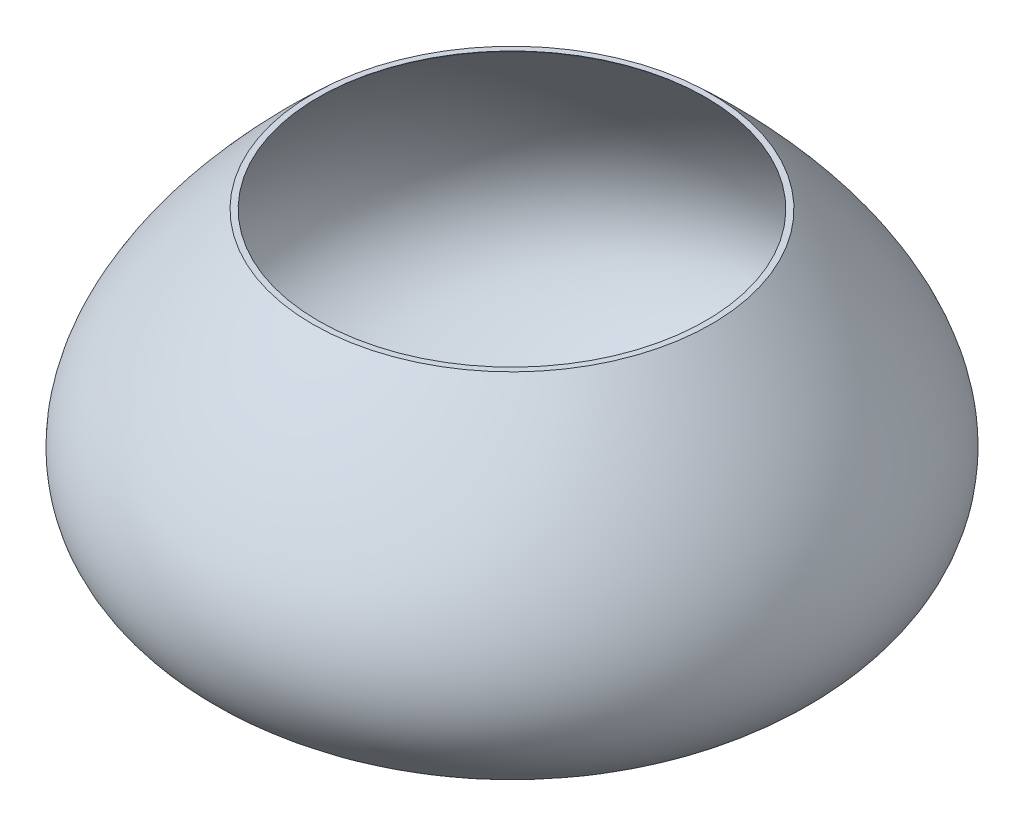
ISO-10303-21;
HEADER;
FILE_DESCRIPTION(('STEP AP214'),'2;1');
FILE_NAME('part.step','',(''),(''),'','','');
FILE_SCHEMA(('AUTOMOTIVE_DESIGN { 1 0 10303 214 1 1 1 1 }'));
ENDSEC;
DATA;
#1=APPLICATION_CONTEXT('core data for automotive mechanical design processes');
#2=APPLICATION_PROTOCOL_DEFINITION('international standard','automotive_design',2000,#1);
#3=PRODUCT_CONTEXT('',#1,'mechanical');
#4=PRODUCT('Part','Part','',(#3));
#5=PRODUCT_RELATED_PRODUCT_CATEGORY('part','',(#4));
#6=PRODUCT_DEFINITION_FORMATION('','',#4);
#7=PRODUCT_DEFINITION_CONTEXT('part definition',#1,'design');
#8=PRODUCT_DEFINITION('design','',#6,#7);
#9=PRODUCT_DEFINITION_SHAPE('','',#8);
#10=(LENGTH_UNIT() NAMED_UNIT(*) SI_UNIT(.MILLI.,.METRE.));
#11=(NAMED_UNIT(*) PLANE_ANGLE_UNIT() SI_UNIT($,.RADIAN.));
#12=(NAMED_UNIT(*) SI_UNIT($,.STERADIAN.) SOLID_ANGLE_UNIT());
#13=UNCERTAINTY_MEASURE_WITH_UNIT(LENGTH_MEASURE(1.E-05),#10,'distance_accuracy_value','');
#14=(GEOMETRIC_REPRESENTATION_CONTEXT(3) GLOBAL_UNCERTAINTY_ASSIGNED_CONTEXT((#13)) GLOBAL_UNIT_ASSIGNED_CONTEXT((#10,
#11,#12)) REPRESENTATION_CONTEXT('',''));
#15=CARTESIAN_POINT('',(0.,0.,0.));
#16=DIRECTION('',(0.,0.,1.));
#17=DIRECTION('',(1.,0.,0.));
#18=AXIS2_PLACEMENT_3D('',#15,#16,#17);
#19=CARTESIAN_POINT('',(-50.7284958703985,42.6156665675958,0.));
#20=CARTESIAN_POINT('',(-130.028085948942,-31.1828525754335,0.));
#21=CARTESIAN_POINT('',(-19.3961895975053,-51.5677540741368,0.));
#22=B_SPLINE_CURVE_WITH_KNOTS('',2,(#19,#20,#21),.UNSPECIFIED.,.F.,.F.,(3,3),(0.,1.),.UNSPECIFIED.);
#23=CARTESIAN_POINT('',(0.,42.6156665675958,0.));
#24=DIRECTION('',(0.,1.,0.));
#25=AXIS1_PLACEMENT('',#23,#24);
#26=SURFACE_OF_REVOLUTION('',#22,#25);
#27=CARTESIAN_POINT('',(0.,-51.5677540741368,0.));
#28=DIRECTION('',(0.,1.,0.));
#29=DIRECTION('',(0.,0.,1.));
#30=AXIS2_PLACEMENT_3D('',#27,#28,#29);
#31=CIRCLE('',#30,19.3961895975053);
#32=CARTESIAN_POINT('',(0.,-51.5677540741368,19.3961895975053));
#33=VERTEX_POINT('',#32);
#34=EDGE_CURVE('E41',#33,#33,#31,.T.);
#35=ORIENTED_EDGE('',*,*,#34,.T.);
#36=EDGE_LOOP('',(#35));
#37=FACE_BOUND('',#36,.T.);
#38=CARTESIAN_POINT('',(0.,42.6156665675958,0.));
#39=DIRECTION('',(0.,1.,0.));
#40=DIRECTION('',(0.,0.,1.));
#41=AXIS2_PLACEMENT_3D('',#38,#39,#40);
#42=CIRCLE('',#41,50.7284958703985);
#43=CARTESIAN_POINT('',(0.,42.6156665675958,50.7284958703985));
#44=VERTEX_POINT('',#43);
#45=EDGE_CURVE('E10',#44,#44,#42,.T.);
#46=ORIENTED_EDGE('',*,*,#45,.F.);
#47=EDGE_LOOP('',(#46));
#48=FACE_BOUND('',#47,.T.);
#49=ADVANCED_FACE('F33',(#37,#48),#26,.F.);
#50=CARTESIAN_POINT('',(-50.7284958703985,42.6156665675958,0.));
#51=DIRECTION('',(0.,1.,0.));
#52=DIRECTION('',(0.,0.,1.));
#53=AXIS2_PLACEMENT_3D('',#50,#51,#52);
#54=PLANE('',#53);
#55=CARTESIAN_POINT('',(0.,42.6156665675958,0.));
#56=DIRECTION('',(0.,1.,0.));
#57=DIRECTION('',(0.,0.,1.));
#58=AXIS2_PLACEMENT_3D('',#55,#56,#57);
#59=CIRCLE('',#58,49.2611135505124);
#60=CARTESIAN_POINT('',(0.,42.6156665675958,49.2611135505124));
#61=VERTEX_POINT('',#60);
#62=EDGE_CURVE('E37',#61,#61,#59,.T.);
#63=ORIENTED_EDGE('',*,*,#62,.F.);
#64=EDGE_LOOP('',(#63));
#65=FACE_BOUND('',#64,.T.);
#66=ORIENTED_EDGE('',*,*,#45,.T.);
#67=EDGE_LOOP('',(#66));
#68=FACE_BOUND('',#67,.T.);
#69=ADVANCED_FACE('F78',(#65,#68),#54,.T.);
#70=CARTESIAN_POINT('',(0.,-51.5677540741368,0.));
#71=DIRECTION('',(0.,-1.,0.));
#72=DIRECTION('',(0.,0.,-1.));
#73=AXIS2_PLACEMENT_3D('',#70,#71,#72);
#74=PLANE('',#73);
#75=ORIENTED_EDGE('',*,*,#34,.F.);
#76=EDGE_LOOP('',(#75));
#77=FACE_BOUND('',#76,.T.);
#78=ADVANCED_FACE('F75',(#77),#74,.T.);
#79=CARTESIAN_POINT('',(0.,-50.5843634446969,0.));
#80=DIRECTION('',(0.,-1.,0.));
#81=DIRECTION('',(0.,0.,-1.));
#82=AXIS2_PLACEMENT_3D('',#79,#80,#81);
#83=PLANE('',#82);
#84=CARTESIAN_POINT('',(0.,-50.5843634446969,0.));
#85=DIRECTION('',(0.,1.,0.));
#86=DIRECTION('',(0.,0.,1.));
#87=AXIS2_PLACEMENT_3D('',#84,#85,#86);
#88=CIRCLE('',#87,19.2146878897174);
#89=CARTESIAN_POINT('',(0.,-50.5843634446969,19.2146878897174));
#90=VERTEX_POINT('',#89);
#91=EDGE_CURVE('E50',#90,#90,#88,.T.);
#92=ORIENTED_EDGE('',*,*,#91,.T.);
#93=EDGE_LOOP('',(#92));
#94=FACE_BOUND('',#93,.T.);
#95=ADVANCED_FACE('F71',(#94),#83,.F.);
#96=CARTESIAN_POINT('',(-50.0470102163547,41.8838350956486,0.));
#97=CARTESIAN_POINT('',(-50.3258437096037,41.6241837513158,0.));
#98=CARTESIAN_POINT('',(-50.6023301269103,41.3658986733701,0.));
#99=CARTESIAN_POINT('',(-51.1556551569572,40.8463384670707,0.));
#100=CARTESIAN_POINT('',(-51.4317092392776,40.5859562664432,0.));
#101=CARTESIAN_POINT('',(-52.2580248060261,39.8029258201448,0.));
#102=CARTESIAN_POINT('',(-52.8064256894913,39.2784103825978,0.));
#103=CARTESIAN_POINT('',(-54.4437116957967,37.6970483158113,0.));
#104=CARTESIAN_POINT('',(-55.5246991014262,36.6323937921897,0.));
#105=CARTESIAN_POINT('',(-58.7315315788964,33.4042840263082,0.));
#106=CARTESIAN_POINT('',(-60.821705640731,31.2068347837701,0.));
#107=CARTESIAN_POINT('',(-64.8736389747032,26.7023904697895,0.));
#108=CARTESIAN_POINT('',(-66.8357625528101,24.3954108355314,0.));
#109=CARTESIAN_POINT('',(-70.5801975268923,19.6480617657973,0.));
#110=CARTESIAN_POINT('',(-72.363218661924,17.2075759004857,0.));
#111=CARTESIAN_POINT('',(-75.6639317446825,12.1651442504666,0.));
#112=CARTESIAN_POINT('',(-77.1828949415244,9.56250656816085,0.));
#113=CARTESIAN_POINT('',(-79.1508496521266,5.52053947860333,0.));
#114=CARTESIAN_POINT('',(-79.7544533177836,4.15029922236088,0.));
#115=CARTESIAN_POINT('',(-80.8286403154789,1.36501877511502,0.));
#116=CARTESIAN_POINT('',(-81.299207918134,-0.0501519877099527,0.));
#117=CARTESIAN_POINT('',(-82.0718969999994,-2.91838189055625,0.));
#118=CARTESIAN_POINT('',(-82.3738479452341,-4.37159693233014,0.));
#119=CARTESIAN_POINT('',(-82.7689979817292,-7.29852293386176,0.));
#120=CARTESIAN_POINT('',(-82.8617748389176,-8.7722786900836,0.));
#121=CARTESIAN_POINT('',(-82.8020258639494,-11.7087712294951,0.));
#122=CARTESIAN_POINT('',(-82.6489714106115,-13.1712340771969,0.));
#123=CARTESIAN_POINT('',(-82.0800136139683,-16.0422431243442,0.));
#124=CARTESIAN_POINT('',(-81.6639729912247,-17.4502619461596,0.));
#125=CARTESIAN_POINT('',(-80.5825122919221,-20.1708947390536,0.));
#126=CARTESIAN_POINT('',(-79.9175506740652,-21.4831844228895,0.));
#127=CARTESIAN_POINT('',(-78.3779381697122,-23.9868773203778,0.));
#128=CARTESIAN_POINT('',(-77.503863940475,-25.1783700414302,0.));
#129=CARTESIAN_POINT('',(-75.5942985663853,-27.4347408930068,0.));
#130=CARTESIAN_POINT('',(-74.5590996945951,-28.4998819692524,0.));
#131=CARTESIAN_POINT('',(-72.3700351134111,-30.5111595679,0.));
#132=CARTESIAN_POINT('',(-71.2162084181214,-31.4575031695101,0.));
#133=CARTESIAN_POINT('',(-67.6256569751839,-34.1378210281417,0.));
#134=CARTESIAN_POINT('',(-65.063151448962,-35.7140101622726,0.));
#135=CARTESIAN_POINT('',(-59.7598847419551,-38.5516794629408,0.));
#136=CARTESIAN_POINT('',(-57.0172219768374,-39.8135006537529,0.));
#137=CARTESIAN_POINT('',(-51.4293254057354,-42.1037959098136,0.));
#138=CARTESIAN_POINT('',(-48.5831541282288,-43.1320155532147,0.));
#139=CARTESIAN_POINT('',(-42.8278684468857,-45.0103865965986,0.));
#140=CARTESIAN_POINT('',(-39.9183310594402,-45.8602997929853,0.));
#141=CARTESIAN_POINT('',(-34.0586032158574,-47.4202161385998,0.));
#142=CARTESIAN_POINT('',(-31.1082152879589,-48.1300608476452,0.));
#143=CARTESIAN_POINT('',(-26.6621323936747,-49.1102192688236,0.));
#144=CARTESIAN_POINT('',(-25.1766330490047,-49.4227648952257,0.));
#145=CARTESIAN_POINT('',(-22.944071535398,-49.8723426646443,0.));
#146=CARTESIAN_POINT('',(-22.1991633539238,-50.0189918674455,0.));
#147=CARTESIAN_POINT('',(-20.7080312227311,-50.3061706248618,0.));
#148=CARTESIAN_POINT('',(-19.9640468697085,-50.4460563157262,0.));
#149=CARTESIAN_POINT('',(-19.2146878897174,-50.5843634446969,0.));
#150=B_SPLINE_CURVE_WITH_KNOTS('',3,(#96,#97,#98,#99,#100,#101,#102,#103,#104,#105,#106,#107,
#108,#109,#110,#111,#112,#113,#114,#115,#116,#117,#118,#119,#120,#121,#122,#123,#124,#125,#126,
#127,#128,#129,#130,#131,#132,#133,#134,#135,#136,#137,#138,#139,#140,#141,#142,#143,#144,#145,
#146,#147,#148,#149),.UNSPECIFIED.,.F.,.F.,(4,2,2,2,2,2,2,2,2,2,2,2,2,2,2,2,2,2,2,2,2,2,2,2,2,2,
4),(0.,0.00781249999999998,0.015625,0.0312499999999999,0.0624999999999998,0.125,0.1875,0.25,
0.312499999999999,0.343749999999999,0.374999999999999,0.406249999999999,0.437499999999999,
0.468749999999999,0.499999999999999,0.531249999999999,0.562499999999999,0.593749999999999,
0.624999999999999,0.687499999999999,0.749999999999999,0.812499999999999,0.874999999999999,
0.9375,0.96875,0.984375,1.),.UNSPECIFIED.);
#151=CARTESIAN_POINT('',(0.,50.2287862214904,0.));
#152=DIRECTION('',(0.,1.,0.));
#153=AXIS1_PLACEMENT('',#151,#152);
#154=SURFACE_OF_REVOLUTION('',#150,#153);
#155=ORIENTED_EDGE('',*,*,#91,.F.);
#156=EDGE_LOOP('',(#155));
#157=FACE_BOUND('',#156,.T.);
#158=CARTESIAN_POINT('',(0.,41.8838350956486,0.));
#159=DIRECTION('',(0.,1.,0.));
#160=DIRECTION('',(0.,0.,1.));
#161=AXIS2_PLACEMENT_3D('',#158,#159,#160);
#162=CIRCLE('',#161,50.0470102163547);
#163=CARTESIAN_POINT('',(0.,41.8838350956486,50.0470102163547));
#164=VERTEX_POINT('',#163);
#165=EDGE_CURVE('E56',#164,#164,#162,.T.);
#166=ORIENTED_EDGE('',*,*,#165,.T.);
#167=EDGE_LOOP('',(#166));
#168=FACE_BOUND('',#167,.T.);
#169=ADVANCED_FACE('F66',(#157,#168),#154,.T.);
#170=CARTESIAN_POINT('',(0.,50.2287862214904,0.));
#171=DIRECTION('',(0.,-1.,0.));
#172=DIRECTION('',(0.,0.,-1.));
#173=AXIS2_PLACEMENT_3D('',#170,#171,#172);
#174=CONICAL_SURFACE('',#173,41.0855627823353,0.821005556519486);
#175=ORIENTED_EDGE('',*,*,#62,.T.);
#176=EDGE_LOOP('',(#175));
#177=FACE_BOUND('',#176,.T.);
#178=ORIENTED_EDGE('',*,*,#165,.F.);
#179=EDGE_LOOP('',(#178));
#180=FACE_BOUND('',#179,.T.);
#181=ADVANCED_FACE('F70',(#177,#180),#174,.F.);
#182=CLOSED_SHELL('',(#49,#69,#78,#95,#169,#181));
#183=MANIFOLD_SOLID_BREP('B2',#182);
#184=ADVANCED_BREP_SHAPE_REPRESENTATION('',(#18,#183),#14);
#185=SHAPE_DEFINITION_REPRESENTATION(#9,#184);
ENDSEC;
END-ISO-10303-21;
